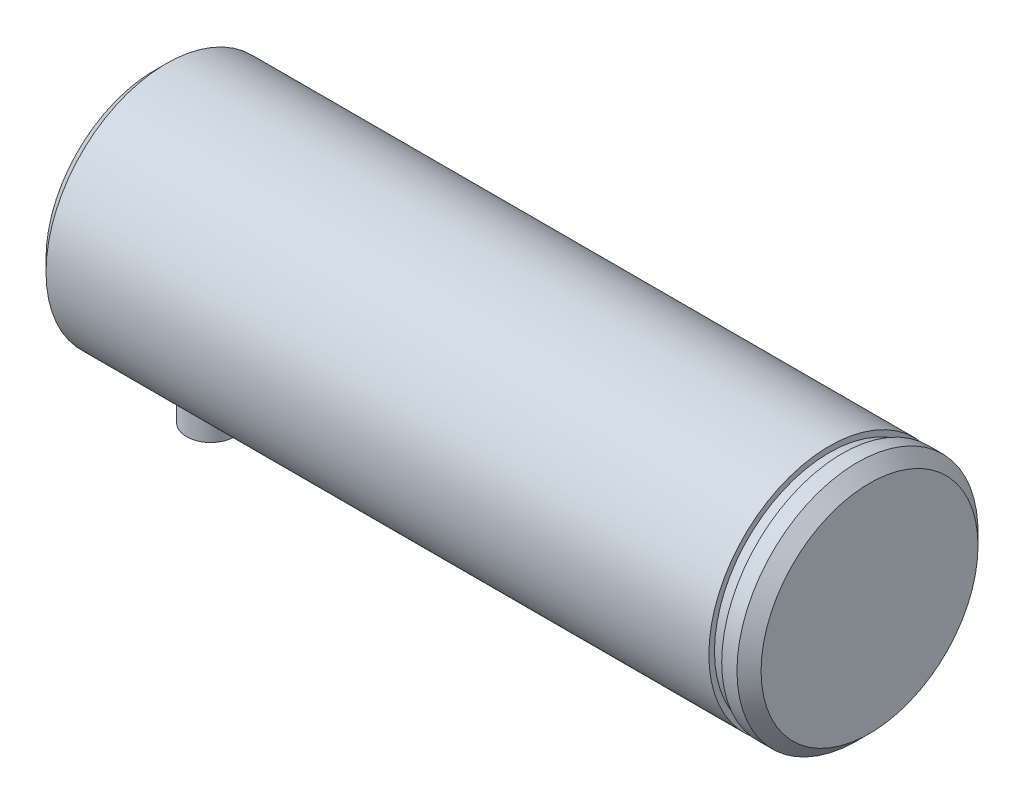
ISO-10303-21;
HEADER;
FILE_DESCRIPTION(('STEP AP214'),'2;1');
FILE_NAME('part.step','',(''),(''),'','','');
FILE_SCHEMA(('AUTOMOTIVE_DESIGN { 1 0 10303 214 1 1 1 1 }'));
ENDSEC;
DATA;
#1=APPLICATION_CONTEXT('core data for automotive mechanical design processes');
#2=APPLICATION_PROTOCOL_DEFINITION('international standard','automotive_design',2000,#1);
#3=PRODUCT_CONTEXT('',#1,'mechanical');
#4=PRODUCT('Part','Part','',(#3));
#5=PRODUCT_RELATED_PRODUCT_CATEGORY('part','',(#4));
#6=PRODUCT_DEFINITION_FORMATION('','',#4);
#7=PRODUCT_DEFINITION_CONTEXT('part definition',#1,'design');
#8=PRODUCT_DEFINITION('design','',#6,#7);
#9=PRODUCT_DEFINITION_SHAPE('','',#8);
#10=(LENGTH_UNIT() NAMED_UNIT(*) SI_UNIT(.MILLI.,.METRE.));
#11=(NAMED_UNIT(*) PLANE_ANGLE_UNIT() SI_UNIT($,.RADIAN.));
#12=(NAMED_UNIT(*) SI_UNIT($,.STERADIAN.) SOLID_ANGLE_UNIT());
#13=UNCERTAINTY_MEASURE_WITH_UNIT(LENGTH_MEASURE(1.E-05),#10,'distance_accuracy_value','');
#14=(GEOMETRIC_REPRESENTATION_CONTEXT(3) GLOBAL_UNCERTAINTY_ASSIGNED_CONTEXT((#13)) GLOBAL_UNIT_ASSIGNED_CONTEXT((#10,
#11,#12)) REPRESENTATION_CONTEXT('',''));
#15=CARTESIAN_POINT('',(0.,0.,0.));
#16=DIRECTION('',(0.,0.,1.));
#17=DIRECTION('',(1.,0.,0.));
#18=AXIS2_PLACEMENT_3D('',#15,#16,#17);
#19=CARTESIAN_POINT('',(39.5,0.,0.));
#20=DIRECTION('',(-1.,0.,0.));
#21=DIRECTION('',(0.,0.,1.));
#22=AXIS2_PLACEMENT_3D('',#19,#20,#21);
#23=CYLINDRICAL_SURFACE('',#22,15.);
#24=CARTESIAN_POINT('',(41.1,0.,0.));
#25=DIRECTION('',(-1.,0.,0.));
#26=DIRECTION('',(0.,0.,1.));
#27=AXIS2_PLACEMENT_3D('',#24,#25,#26);
#28=CIRCLE('',#27,15.);
#29=CARTESIAN_POINT('',(41.1,0.,15.));
#30=VERTEX_POINT('',#29);
#31=EDGE_CURVE('E58',#30,#30,#28,.T.);
#32=ORIENTED_EDGE('',*,*,#31,.F.);
#33=EDGE_LOOP('',(#32));
#34=FACE_BOUND('',#33,.T.);
#35=CARTESIAN_POINT('',(43.,0.,0.));
#36=DIRECTION('',(-1.,0.,0.));
#37=DIRECTION('',(0.,0.,1.));
#38=AXIS2_PLACEMENT_3D('',#35,#36,#37);
#39=CIRCLE('',#38,15.);
#40=CARTESIAN_POINT('',(43.,0.,15.));
#41=VERTEX_POINT('',#40);
#42=EDGE_CURVE('E67',#41,#41,#39,.T.);
#43=ORIENTED_EDGE('',*,*,#42,.T.);
#44=EDGE_LOOP('',(#43));
#45=FACE_BOUND('',#44,.T.);
#46=ADVANCED_FACE('F31',(#34,#45),#23,.T.);
#47=CARTESIAN_POINT('',(-43.,0.,0.));
#48=DIRECTION('',(-1.,0.,0.));
#49=DIRECTION('',(0.,0.,1.));
#50=AXIS2_PLACEMENT_3D('',#47,#48,#49);
#51=CIRCLE('',#50,15.);
#52=CARTESIAN_POINT('',(-43.,0.,15.));
#53=VERTEX_POINT('',#52);
#54=EDGE_CURVE('E10',#53,#53,#51,.T.);
#55=ORIENTED_EDGE('',*,*,#54,.F.);
#56=EDGE_LOOP('',(#55));
#57=FACE_BOUND('',#56,.T.);
#58=CARTESIAN_POINT('',(-37.5,-14.6969384566991,3.));
#59=CARTESIAN_POINT('',(-37.3333068735265,-14.6969417707994,2.99999383762582));
#60=CARTESIAN_POINT('',(-37.16653613,-14.6998052480611,2.98605951515444));
#61=CARTESIAN_POINT('',(-36.8377124845706,-14.7109329391462,2.93073685074853));
#62=CARTESIAN_POINT('',(-36.6756634660921,-14.7192014743436,2.88932654121148));
#63=CARTESIAN_POINT('',(-36.3610880899374,-14.7401662116556,2.78038734785924));
#64=CARTESIAN_POINT('',(-36.2085524354022,-14.7528580086323,2.71288444245787));
#65=CARTESIAN_POINT('',(-35.9169754659091,-14.7812339844198,2.55374732301152));
#66=CARTESIAN_POINT('',(-35.7779333983863,-14.7969179962038,2.46211445580345));
#67=CARTESIAN_POINT('',(-35.5153169884384,-14.8297589908276,2.25593722696031));
#68=CARTESIAN_POINT('',(-35.3919612363481,-14.8469321351174,2.14111696773995));
#69=CARTESIAN_POINT('',(-35.1661273992631,-14.880674169078,1.89242036706393));
#70=CARTESIAN_POINT('',(-35.0636507777484,-14.8972430163249,1.75854269093395));
#71=CARTESIAN_POINT('',(-34.8816359471146,-14.9280838925269,1.47408406777277));
#72=CARTESIAN_POINT('',(-34.8023054585501,-14.9423346432465,1.32336770301663));
#73=CARTESIAN_POINT('',(-34.6701751888556,-14.9667521065089,1.01041245116181));
#74=CARTESIAN_POINT('',(-34.617372924297,-14.9769192013236,0.848174644261657));
#75=CARTESIAN_POINT('',(-34.5404784191411,-14.9919096206526,0.519050319835481));
#76=CARTESIAN_POINT('',(-34.516017067287,-14.9968015886438,0.35225321764444));
#77=CARTESIAN_POINT('',(-34.4953471444851,-15.0009276355081,0.0168557053126068));
#78=CARTESIAN_POINT('',(-34.4991358510625,-15.0001622595828,-0.151744529495531));
#79=CARTESIAN_POINT('',(-34.5345785406467,-14.9931130460555,-0.483426002230767));
#80=CARTESIAN_POINT('',(-34.5658349315035,-14.9869079509751,-0.646551642895411));
#81=CARTESIAN_POINT('',(-34.6546950973767,-14.9697653147823,-0.965194879740904));
#82=CARTESIAN_POINT('',(-34.7122999265756,-14.9588275843212,-1.12071217124139));
#83=CARTESIAN_POINT('',(-34.8525901204418,-14.9333188805988,-1.42085838960266));
#84=CARTESIAN_POINT('',(-34.9354312533147,-14.9187254452567,-1.5654125224017));
#85=CARTESIAN_POINT('',(-35.1237272317098,-14.8875140842136,-1.83871513757927));
#86=CARTESIAN_POINT('',(-35.2291846793116,-14.8708959256567,-1.967461798575));
#87=CARTESIAN_POINT('',(-35.4619008663254,-14.8371289309338,-2.20785429316037));
#88=CARTESIAN_POINT('',(-35.5895075601888,-14.8199758937255,-2.3191629497209));
#89=CARTESIAN_POINT('',(-35.8617493273523,-14.7873471479628,-2.51885547953042));
#90=CARTESIAN_POINT('',(-36.0063847226496,-14.7718714711364,-2.60723891918325));
#91=CARTESIAN_POINT('',(-36.3090624954654,-14.7443414241877,-2.75868844440565));
#92=CARTESIAN_POINT('',(-36.467132902919,-14.7322944469065,-2.82169994333313));
#93=CARTESIAN_POINT('',(-36.791913971172,-14.7130942896382,-2.92017102488275));
#94=CARTESIAN_POINT('',(-36.9586235028572,-14.7059404718528,-2.95563419836993));
#95=CARTESIAN_POINT('',(-37.2928945739971,-14.6974643780348,-2.99749801810816));
#96=CARTESIAN_POINT('',(-37.460392722931,-14.6960444117146,-3.00438557669374));
#97=CARTESIAN_POINT('',(-37.794144669599,-14.6989345706656,-2.99021288493222));
#98=CARTESIAN_POINT('',(-37.9603985373566,-14.7032443710116,-2.96915421936733));
#99=CARTESIAN_POINT('',(-38.2853059208767,-14.7170169748474,-2.90010662422247));
#100=CARTESIAN_POINT('',(-38.4440170291073,-14.7264299704349,-2.8523778625179));
#101=CARTESIAN_POINT('',(-38.7511898370862,-14.7493046805499,-2.73162310592556));
#102=CARTESIAN_POINT('',(-38.8996506913072,-14.7627667285881,-2.65859502711953));
#103=CARTESIAN_POINT('',(-39.1842393298505,-14.7924421788612,-2.48821242664679));
#104=CARTESIAN_POINT('',(-39.3201811389025,-14.8086891559471,-2.39055323394826));
#105=CARTESIAN_POINT('',(-39.5739249360027,-14.8420117147991,-2.17408671663814));
#106=CARTESIAN_POINT('',(-39.6917250547478,-14.8590873817145,-2.05527721543362));
#107=CARTESIAN_POINT('',(-39.9076876775567,-14.8924603760765,-1.79769682049368));
#108=CARTESIAN_POINT('',(-40.00552096395,-14.9087417312605,-1.65864749678889));
#109=CARTESIAN_POINT('',(-40.1764376444987,-14.9384138288586,-1.36580368990427));
#110=CARTESIAN_POINT('',(-40.2495220780343,-14.9518046926563,-1.21200982630052));
#111=CARTESIAN_POINT('',(-40.3683866152399,-14.974118821832,-0.894908042472038));
#112=CARTESIAN_POINT('',(-40.4143215546788,-14.9830673742781,-0.731660020434235));
#113=CARTESIAN_POINT('',(-40.4780737429915,-14.9955970781298,-0.399568364039736));
#114=CARTESIAN_POINT('',(-40.495894378427,-14.9991788759955,-0.230725406133636));
#115=CARTESIAN_POINT('',(-40.5027809428887,-15.0005562136234,0.104618681710863));
#116=CARTESIAN_POINT('',(-40.4923418413687,-14.9984513564799,0.271109436424482));
#117=CARTESIAN_POINT('',(-40.4440981483565,-14.9889013068102,0.59991309394695));
#118=CARTESIAN_POINT('',(-40.4062939009556,-14.9814561814329,0.762226049261168));
#119=CARTESIAN_POINT('',(-40.3046130237252,-14.9620649509476,1.07775824923519));
#120=CARTESIAN_POINT('',(-40.2407958656071,-14.9501291174284,1.23099732972049));
#121=CARTESIAN_POINT('',(-40.0889632760067,-14.9230416637104,1.52466366055821));
#122=CARTESIAN_POINT('',(-40.0009459322865,-14.9078897894096,1.66508989730354));
#123=CARTESIAN_POINT('',(-39.8015418388161,-14.8757279747022,1.93159167031775));
#124=CARTESIAN_POINT('',(-39.6898009908487,-14.858692002537,2.05739914834453));
#125=CARTESIAN_POINT('',(-39.4468492797037,-14.8248366872359,2.28864785327552));
#126=CARTESIAN_POINT('',(-39.3156338115602,-14.8080173963616,2.39408424962674));
#127=CARTESIAN_POINT('',(-39.0357620499287,-14.7763002820179,2.58267665834995));
#128=CARTESIAN_POINT('',(-38.8869331166362,-14.7614251071368,2.66558044385427));
#129=CARTESIAN_POINT('',(-38.5772016802197,-14.7355571137924,2.80507214779868));
#130=CARTESIAN_POINT('',(-38.4163102839384,-14.7245607757495,2.86168393792249));
#131=CARTESIAN_POINT('',(-38.1292126336714,-14.7098904341354,2.93600741957297));
#132=CARTESIAN_POINT('',(-38.0046437414581,-14.7050635474382,2.95996169557105));
#133=CARTESIAN_POINT('',(-37.7533981363466,-14.6985863537725,2.99196005387913));
#134=CARTESIAN_POINT('',(-37.6267214962666,-14.6969359372925,3.00000468468793));
#135=CARTESIAN_POINT('',(-37.5,-14.6969384566991,3.));
#136=B_SPLINE_CURVE_WITH_KNOTS('',3,(#58,#59,#60,#61,#62,#63,#64,#65,#66,#67,#68,#69,#70,#71,
#72,#73,#74,#75,#76,#77,#78,#79,#80,#81,#82,#83,#84,#85,#86,#87,#88,#89,#90,#91,#92,#93,#94,#95,
#96,#97,#98,#99,#100,#101,#102,#103,#104,#105,#106,#107,#108,#109,#110,#111,#112,#113,#114,#115,
#116,#117,#118,#119,#120,#121,#122,#123,#124,#125,#126,#127,#128,#129,#130,#131,#132,#133,#134,
#135),.UNSPECIFIED.,.T.,.F.,(4,2,2,2,2,2,2,2,2,2,2,2,2,2,2,2,2,2,2,2,2,2,2,2,2,2,2,2,2,2,2,2,2,
2,2,2,2,2,4),(0.,0.499615391608283,0.999630717852891,1.49914949382176,1.99864039457959,
2.50446757645311,3.01033020106266,3.52060201312351,4.0308260473968,4.53432746649242,
5.03778036348745,5.53406368900613,6.03036687221251,6.52979772666911,7.02928607310199,
7.53748040287451,8.04568434368162,8.5549758951833,9.06420105048075,9.56471273413782,
10.0651960358526,10.5608802534996,11.056605310632,11.5587917932356,12.0610299861063,
12.5709780520035,13.0809046989032,13.5878944073595,14.0948230407488,14.5929305224406,
15.0910317410027,15.5880005122636,16.0850085640405,16.5900345607679,17.0951801666934,
17.6057669573882,18.115889252706,18.4957141091449,18.8755258705644),.UNSPECIFIED.);
#137=CARTESIAN_POINT('',(-37.5,-14.6969384566991,3.));
#138=VERTEX_POINT('',#137);
#139=EDGE_CURVE('E35',#138,#138,#136,.T.);
#140=ORIENTED_EDGE('',*,*,#139,.T.);
#141=EDGE_LOOP('',(#140));
#142=FACE_BOUND('',#141,.T.);
#143=CARTESIAN_POINT('',(39.5,0.,0.));
#144=DIRECTION('',(-1.,0.,0.));
#145=DIRECTION('',(0.,0.,1.));
#146=AXIS2_PLACEMENT_3D('',#143,#144,#145);
#147=CIRCLE('',#146,15.);
#148=CARTESIAN_POINT('',(39.5,0.,15.));
#149=VERTEX_POINT('',#148);
#150=EDGE_CURVE('E61',#149,#149,#147,.T.);
#151=ORIENTED_EDGE('',*,*,#150,.T.);
#152=EDGE_LOOP('',(#151));
#153=FACE_BOUND('',#152,.T.);
#154=ADVANCED_FACE('F88',(#57,#142,#153),#23,.T.);
#155=CARTESIAN_POINT('',(-44.5,0.,0.));
#156=DIRECTION('',(1.,0.,0.));
#157=DIRECTION('',(0.,0.,-1.));
#158=AXIS2_PLACEMENT_3D('',#155,#156,#157);
#159=CONICAL_SURFACE('',#158,13.5,0.785398163397448);
#160=ORIENTED_EDGE('',*,*,#54,.T.);
#161=EDGE_LOOP('',(#160));
#162=FACE_BOUND('',#161,.T.);
#163=CARTESIAN_POINT('',(-44.5,0.,0.));
#164=DIRECTION('',(-1.,0.,0.));
#165=DIRECTION('',(0.,0.,1.));
#166=AXIS2_PLACEMENT_3D('',#163,#164,#165);
#167=CIRCLE('',#166,13.5);
#168=CARTESIAN_POINT('',(-44.5,0.,13.5));
#169=VERTEX_POINT('',#168);
#170=EDGE_CURVE('E43',#169,#169,#167,.T.);
#171=ORIENTED_EDGE('',*,*,#170,.F.);
#172=EDGE_LOOP('',(#171));
#173=FACE_BOUND('',#172,.T.);
#174=ADVANCED_FACE('F93',(#162,#173),#159,.T.);
#175=CARTESIAN_POINT('',(-44.5,0.,0.));
#176=DIRECTION('',(1.,0.,0.));
#177=DIRECTION('',(0.,0.,-1.));
#178=AXIS2_PLACEMENT_3D('',#175,#176,#177);
#179=PLANE('',#178);
#180=ORIENTED_EDGE('',*,*,#170,.T.);
#181=EDGE_LOOP('',(#180));
#182=FACE_BOUND('',#181,.T.);
#183=ADVANCED_FACE('F33',(#182),#179,.F.);
#184=CARTESIAN_POINT('',(-37.5,-21.,0.));
#185=DIRECTION('',(0.,1.,0.));
#186=DIRECTION('',(0.,0.,1.));
#187=AXIS2_PLACEMENT_3D('',#184,#185,#186);
#188=CYLINDRICAL_SURFACE('',#187,3.);
#189=CARTESIAN_POINT('',(-37.5,-21.,0.));
#190=DIRECTION('',(0.,1.,0.));
#191=DIRECTION('',(0.,0.,1.));
#192=AXIS2_PLACEMENT_3D('',#189,#190,#191);
#193=CIRCLE('',#192,3.);
#194=CARTESIAN_POINT('',(-37.5,-21.,3.));
#195=VERTEX_POINT('',#194);
#196=EDGE_CURVE('E49',#195,#195,#193,.T.);
#197=ORIENTED_EDGE('',*,*,#196,.T.);
#198=EDGE_LOOP('',(#197));
#199=FACE_BOUND('',#198,.T.);
#200=ORIENTED_EDGE('',*,*,#139,.F.);
#201=EDGE_LOOP('',(#200));
#202=FACE_BOUND('',#201,.T.);
#203=ADVANCED_FACE('F99',(#199,#202),#188,.T.);
#204=CARTESIAN_POINT('',(-37.5,-21.,0.));
#205=DIRECTION('',(0.,1.,0.));
#206=DIRECTION('',(0.,0.,1.));
#207=AXIS2_PLACEMENT_3D('',#204,#205,#206);
#208=PLANE('',#207);
#209=ORIENTED_EDGE('',*,*,#196,.F.);
#210=EDGE_LOOP('',(#209));
#211=FACE_BOUND('',#210,.T.);
#212=ADVANCED_FACE('F103',(#211),#208,.F.);
#213=CARTESIAN_POINT('',(39.5,15.,0.));
#214=DIRECTION('',(1.,0.,0.));
#215=DIRECTION('',(0.,0.,-1.));
#216=AXIS2_PLACEMENT_3D('',#213,#214,#215);
#217=PLANE('',#216);
#218=CARTESIAN_POINT('',(39.5,0.,0.));
#219=DIRECTION('',(-1.,0.,0.));
#220=DIRECTION('',(0.,0.,1.));
#221=AXIS2_PLACEMENT_3D('',#218,#219,#220);
#222=CIRCLE('',#221,14.3);
#223=CARTESIAN_POINT('',(39.5,0.,14.3));
#224=VERTEX_POINT('',#223);
#225=EDGE_CURVE('E52',#224,#224,#222,.T.);
#226=ORIENTED_EDGE('',*,*,#225,.T.);
#227=EDGE_LOOP('',(#226));
#228=FACE_BOUND('',#227,.T.);
#229=ORIENTED_EDGE('',*,*,#150,.F.);
#230=EDGE_LOOP('',(#229));
#231=FACE_BOUND('',#230,.T.);
#232=ADVANCED_FACE('F106',(#228,#231),#217,.T.);
#233=CARTESIAN_POINT('',(77.,0.,0.));
#234=DIRECTION('',(-1.,0.,0.));
#235=DIRECTION('',(0.,0.,1.));
#236=AXIS2_PLACEMENT_3D('',#233,#234,#235);
#237=CYLINDRICAL_SURFACE('',#236,14.3);
#238=CARTESIAN_POINT('',(41.1,0.,0.));
#239=DIRECTION('',(-1.,0.,0.));
#240=DIRECTION('',(0.,0.,1.));
#241=AXIS2_PLACEMENT_3D('',#238,#239,#240);
#242=CIRCLE('',#241,14.3);
#243=CARTESIAN_POINT('',(41.1,0.,14.3));
#244=VERTEX_POINT('',#243);
#245=EDGE_CURVE('E55',#244,#244,#242,.T.);
#246=ORIENTED_EDGE('',*,*,#245,.T.);
#247=EDGE_LOOP('',(#246));
#248=FACE_BOUND('',#247,.T.);
#249=ORIENTED_EDGE('',*,*,#225,.F.);
#250=EDGE_LOOP('',(#249));
#251=FACE_BOUND('',#250,.T.);
#252=ADVANCED_FACE('F84',(#248,#251),#237,.T.);
#253=CARTESIAN_POINT('',(41.1,14.3,0.));
#254=DIRECTION('',(-1.,0.,0.));
#255=DIRECTION('',(0.,0.,1.));
#256=AXIS2_PLACEMENT_3D('',#253,#254,#255);
#257=PLANE('',#256);
#258=ORIENTED_EDGE('',*,*,#31,.T.);
#259=EDGE_LOOP('',(#258));
#260=FACE_BOUND('',#259,.T.);
#261=ORIENTED_EDGE('',*,*,#245,.F.);
#262=EDGE_LOOP('',(#261));
#263=FACE_BOUND('',#262,.T.);
#264=ADVANCED_FACE('F75',(#260,#263),#257,.T.);
#265=CARTESIAN_POINT('',(43.,0.,0.));
#266=DIRECTION('',(-1.,0.,0.));
#267=DIRECTION('',(0.,0.,1.));
#268=AXIS2_PLACEMENT_3D('',#265,#266,#267);
#269=CONICAL_SURFACE('',#268,15.,0.785398163397448);
#270=CARTESIAN_POINT('',(44.5,0.,0.));
#271=DIRECTION('',(-1.,0.,0.));
#272=DIRECTION('',(0.,0.,1.));
#273=AXIS2_PLACEMENT_3D('',#270,#271,#272);
#274=CIRCLE('',#273,13.5);
#275=CARTESIAN_POINT('',(44.5,0.,13.5));
#276=VERTEX_POINT('',#275);
#277=EDGE_CURVE('E64',#276,#276,#274,.T.);
#278=ORIENTED_EDGE('',*,*,#277,.T.);
#279=EDGE_LOOP('',(#278));
#280=FACE_BOUND('',#279,.T.);
#281=ORIENTED_EDGE('',*,*,#42,.F.);
#282=EDGE_LOOP('',(#281));
#283=FACE_BOUND('',#282,.T.);
#284=ADVANCED_FACE('F72',(#280,#283),#269,.T.);
#285=CARTESIAN_POINT('',(44.5,15.,0.));
#286=DIRECTION('',(-1.,0.,0.));
#287=DIRECTION('',(0.,0.,1.));
#288=AXIS2_PLACEMENT_3D('',#285,#286,#287);
#289=PLANE('',#288);
#290=ORIENTED_EDGE('',*,*,#277,.F.);
#291=EDGE_LOOP('',(#290));
#292=FACE_BOUND('',#291,.T.);
#293=ADVANCED_FACE('F74',(#292),#289,.F.);
#294=CLOSED_SHELL('',(#46,#154,#174,#183,#203,#212,#232,#252,#264,#284,#293));
#295=MANIFOLD_SOLID_BREP('B2',#294);
#296=ADVANCED_BREP_SHAPE_REPRESENTATION('',(#18,#295),#14);
#297=SHAPE_DEFINITION_REPRESENTATION(#9,#296);
ENDSEC;
END-ISO-10303-21;
